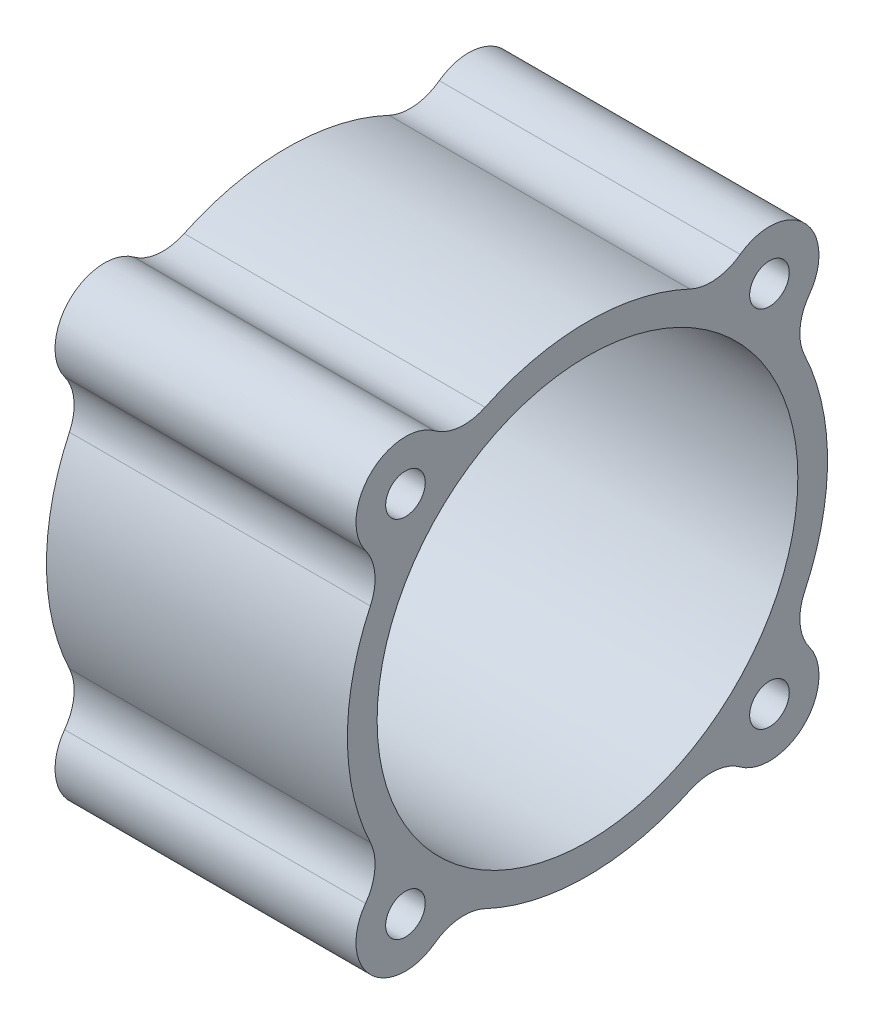
ISO-10303-21;
HEADER;
FILE_DESCRIPTION(('STEP AP214'),'2;1');
FILE_NAME('part.step','',(''),(''),'','','');
FILE_SCHEMA(('AUTOMOTIVE_DESIGN { 1 0 10303 214 1 1 1 1 }'));
ENDSEC;
DATA;
#1=APPLICATION_CONTEXT('core data for automotive mechanical design processes');
#2=APPLICATION_PROTOCOL_DEFINITION('international standard','automotive_design',2000,#1);
#3=PRODUCT_CONTEXT('',#1,'mechanical');
#4=PRODUCT('Part','Part','',(#3));
#5=PRODUCT_RELATED_PRODUCT_CATEGORY('part','',(#4));
#6=PRODUCT_DEFINITION_FORMATION('','',#4);
#7=PRODUCT_DEFINITION_CONTEXT('part definition',#1,'design');
#8=PRODUCT_DEFINITION('design','',#6,#7);
#9=PRODUCT_DEFINITION_SHAPE('','',#8);
#10=(LENGTH_UNIT() NAMED_UNIT(*) SI_UNIT(.MILLI.,.METRE.));
#11=(NAMED_UNIT(*) PLANE_ANGLE_UNIT() SI_UNIT($,.RADIAN.));
#12=(NAMED_UNIT(*) SI_UNIT($,.STERADIAN.) SOLID_ANGLE_UNIT());
#13=UNCERTAINTY_MEASURE_WITH_UNIT(LENGTH_MEASURE(1.E-05),#10,'distance_accuracy_value','');
#14=(GEOMETRIC_REPRESENTATION_CONTEXT(3) GLOBAL_UNCERTAINTY_ASSIGNED_CONTEXT((#13)) GLOBAL_UNIT_ASSIGNED_CONTEXT((#10,
#11,#12)) REPRESENTATION_CONTEXT('',''));
#15=CARTESIAN_POINT('',(0.,0.,0.));
#16=DIRECTION('',(0.,0.,1.));
#17=DIRECTION('',(1.,0.,0.));
#18=AXIS2_PLACEMENT_3D('',#15,#16,#17);
#19=CARTESIAN_POINT('',(15.2,13.2272464074001,6.23943727253676));
#20=DIRECTION('',(1.,0.,0.));
#21=DIRECTION('',(0.,0.,-1.));
#22=AXIS2_PLACEMENT_3D('',#19,#20,#21);
#23=PLANE('',#22);
#24=CARTESIAN_POINT('',(15.2,-18.3847763388395,-18.3847763388395));
#25=DIRECTION('',(1.,0.,0.));
#26=DIRECTION('',(0.,0.,-1.));
#27=AXIS2_PLACEMENT_3D('',#24,#25,#26);
#28=CIRCLE('',#27,2.);
#29=CARTESIAN_POINT('',(15.2,-18.3847763388395,-20.3847763388395));
#30=VERTEX_POINT('',#29);
#31=EDGE_CURVE('E348',#30,#30,#28,.T.);
#32=ORIENTED_EDGE('',*,*,#31,.F.);
#33=EDGE_LOOP('',(#32));
#34=FACE_BOUND('',#33,.T.);
#35=CARTESIAN_POINT('',(15.2,18.3847763388395,18.3847763388395));
#36=DIRECTION('',(1.,0.,0.));
#37=DIRECTION('',(0.,0.,-1.));
#38=AXIS2_PLACEMENT_3D('',#35,#36,#37);
#39=CIRCLE('',#38,2.);
#40=CARTESIAN_POINT('',(15.2,18.3847763388395,16.3847763388395));
#41=VERTEX_POINT('',#40);
#42=EDGE_CURVE('E360',#41,#41,#39,.T.);
#43=ORIENTED_EDGE('',*,*,#42,.F.);
#44=EDGE_LOOP('',(#43));
#45=FACE_BOUND('',#44,.T.);
#46=CARTESIAN_POINT('',(15.2,26.4544928148002,12.4788745450735));
#47=DIRECTION('',(-1.,0.,0.));
#48=DIRECTION('',(0.,0.,-1.));
#49=AXIS2_PLACEMENT_3D('',#46,#47,#48);
#50=CIRCLE('',#49,4.99999999999999);
#51=CARTESIAN_POINT('',(15.2,21.9323572909028,10.3457335971977));
#52=VERTEX_POINT('',#51);
#53=CARTESIAN_POINT('',(15.2,22.4196345768199,15.4318254419565));
#54=VERTEX_POINT('',#53);
#55=EDGE_CURVE('E210',#52,#54,#50,.T.);
#56=ORIENTED_EDGE('',*,*,#55,.T.);
#57=CARTESIAN_POINT('',(15.2,18.3847763388395,18.3847763388395));
#58=DIRECTION('',(1.,0.,0.));
#59=DIRECTION('',(0.,0.,-1.));
#60=AXIS2_PLACEMENT_3D('',#57,#58,#59);
#61=CIRCLE('',#60,5.);
#62=CARTESIAN_POINT('',(15.2,15.4318254419565,22.4196345768199));
#63=VERTEX_POINT('',#62);
#64=EDGE_CURVE('E118',#54,#63,#61,.T.);
#65=ORIENTED_EDGE('',*,*,#64,.T.);
#66=CARTESIAN_POINT('',(15.2,12.4788745450735,26.4544928148002));
#67=DIRECTION('',(-1.,0.,0.));
#68=DIRECTION('',(0.,0.,1.));
#69=AXIS2_PLACEMENT_3D('',#66,#67,#68);
#70=CIRCLE('',#69,5.);
#71=CARTESIAN_POINT('',(15.2,10.3457335971977,21.9323572909027));
#72=VERTEX_POINT('',#71);
#73=EDGE_CURVE('E249',#63,#72,#70,.T.);
#74=ORIENTED_EDGE('',*,*,#73,.T.);
#75=CARTESIAN_POINT('',(15.2,0.,0.));
#76=DIRECTION('',(1.,0.,0.));
#77=DIRECTION('',(0.,0.,-1.));
#78=AXIS2_PLACEMENT_3D('',#75,#76,#77);
#79=CIRCLE('',#78,24.25);
#80=CARTESIAN_POINT('',(15.2,-10.3457335971977,21.9323572909028));
#81=VERTEX_POINT('',#80);
#82=EDGE_CURVE('E268',#72,#81,#79,.T.);
#83=ORIENTED_EDGE('',*,*,#82,.T.);
#84=CARTESIAN_POINT('',(15.2,-12.4788745450735,26.4544928148002));
#85=DIRECTION('',(-1.,0.,0.));
#86=DIRECTION('',(0.,0.,-1.));
#87=AXIS2_PLACEMENT_3D('',#84,#85,#86);
#88=CIRCLE('',#87,5.);
#89=CARTESIAN_POINT('',(15.2,-15.4318254419565,22.4196345768199));
#90=VERTEX_POINT('',#89);
#91=EDGE_CURVE('E265',#81,#90,#88,.T.);
#92=ORIENTED_EDGE('',*,*,#91,.T.);
#93=CARTESIAN_POINT('',(15.2,-18.3847763388395,18.3847763388395));
#94=DIRECTION('',(1.,0.,0.));
#95=DIRECTION('',(0.,0.,-1.));
#96=AXIS2_PLACEMENT_3D('',#93,#94,#95);
#97=CIRCLE('',#96,5.);
#98=CARTESIAN_POINT('',(15.2,-22.4196345768199,15.4318254419565));
#99=VERTEX_POINT('',#98);
#100=EDGE_CURVE('E267',#90,#99,#97,.T.);
#101=ORIENTED_EDGE('',*,*,#100,.T.);
#102=CARTESIAN_POINT('',(15.2,-26.4544928148002,12.4788745450735));
#103=DIRECTION('',(-1.,0.,0.));
#104=DIRECTION('',(0.,0.,1.));
#105=AXIS2_PLACEMENT_3D('',#102,#103,#104);
#106=CIRCLE('',#105,5.);
#107=CARTESIAN_POINT('',(15.2,-21.9323572909028,10.3457335971977));
#108=VERTEX_POINT('',#107);
#109=EDGE_CURVE('E270',#99,#108,#106,.T.);
#110=ORIENTED_EDGE('',*,*,#109,.T.);
#111=CARTESIAN_POINT('',(15.2,0.,0.));
#112=DIRECTION('',(1.,0.,0.));
#113=DIRECTION('',(0.,0.,-1.));
#114=AXIS2_PLACEMENT_3D('',#111,#112,#113);
#115=CIRCLE('',#114,24.25);
#116=CARTESIAN_POINT('',(15.2,-21.9323572909028,-10.3457335971977));
#117=VERTEX_POINT('',#116);
#118=EDGE_CURVE('E276',#108,#117,#115,.T.);
#119=ORIENTED_EDGE('',*,*,#118,.T.);
#120=CARTESIAN_POINT('',(15.2,-26.4544928148002,-12.4788745450735));
#121=DIRECTION('',(-1.,0.,0.));
#122=DIRECTION('',(0.,0.,-1.));
#123=AXIS2_PLACEMENT_3D('',#120,#121,#122);
#124=CIRCLE('',#123,5.);
#125=CARTESIAN_POINT('',(15.2,-22.4196345768199,-15.4318254419565));
#126=VERTEX_POINT('',#125);
#127=EDGE_CURVE('E278',#117,#126,#124,.T.);
#128=ORIENTED_EDGE('',*,*,#127,.T.);
#129=CARTESIAN_POINT('',(15.2,-18.3847763388395,-18.3847763388395));
#130=DIRECTION('',(1.,0.,0.));
#131=DIRECTION('',(0.,0.,-1.));
#132=AXIS2_PLACEMENT_3D('',#129,#130,#131);
#133=CIRCLE('',#132,5.);
#134=CARTESIAN_POINT('',(15.2,-15.4318254419565,-22.4196345768199));
#135=VERTEX_POINT('',#134);
#136=EDGE_CURVE('E280',#126,#135,#133,.T.);
#137=ORIENTED_EDGE('',*,*,#136,.T.);
#138=CARTESIAN_POINT('',(15.2,-12.4788745450735,-26.4544928148002));
#139=DIRECTION('',(-1.,0.,0.));
#140=DIRECTION('',(0.,0.,1.));
#141=AXIS2_PLACEMENT_3D('',#138,#139,#140);
#142=CIRCLE('',#141,5.);
#143=CARTESIAN_POINT('',(15.2,-10.3457335971977,-21.9323572909028));
#144=VERTEX_POINT('',#143);
#145=EDGE_CURVE('E282',#135,#144,#142,.T.);
#146=ORIENTED_EDGE('',*,*,#145,.T.);
#147=CARTESIAN_POINT('',(15.2,0.,0.));
#148=DIRECTION('',(1.,0.,0.));
#149=DIRECTION('',(0.,0.,-1.));
#150=AXIS2_PLACEMENT_3D('',#147,#148,#149);
#151=CIRCLE('',#150,24.25);
#152=CARTESIAN_POINT('',(15.2,10.3457335971977,-21.9323572909028));
#153=VERTEX_POINT('',#152);
#154=EDGE_CURVE('E284',#144,#153,#151,.T.);
#155=ORIENTED_EDGE('',*,*,#154,.T.);
#156=CARTESIAN_POINT('',(15.2,12.4788745450735,-26.4544928148002));
#157=DIRECTION('',(-1.,0.,0.));
#158=DIRECTION('',(0.,0.,-1.));
#159=AXIS2_PLACEMENT_3D('',#156,#157,#158);
#160=CIRCLE('',#159,5.);
#161=CARTESIAN_POINT('',(15.2,15.4318254419565,-22.4196345768199));
#162=VERTEX_POINT('',#161);
#163=EDGE_CURVE('E161',#153,#162,#160,.T.);
#164=ORIENTED_EDGE('',*,*,#163,.T.);
#165=CARTESIAN_POINT('',(15.2,18.3847763388395,-18.3847763388395));
#166=DIRECTION('',(1.,0.,0.));
#167=DIRECTION('',(0.,0.,-1.));
#168=AXIS2_PLACEMENT_3D('',#165,#166,#167);
#169=CIRCLE('',#168,5.);
#170=CARTESIAN_POINT('',(15.2,22.4196345768199,-15.4318254419565));
#171=VERTEX_POINT('',#170);
#172=EDGE_CURVE('E155',#162,#171,#169,.T.);
#173=ORIENTED_EDGE('',*,*,#172,.T.);
#174=CARTESIAN_POINT('',(15.2,26.4544928148002,-12.4788745450735));
#175=DIRECTION('',(-1.,0.,0.));
#176=DIRECTION('',(0.,0.,1.));
#177=AXIS2_PLACEMENT_3D('',#174,#175,#176);
#178=CIRCLE('',#177,5.);
#179=CARTESIAN_POINT('',(15.2,21.9323572909027,-10.3457335971977));
#180=VERTEX_POINT('',#179);
#181=EDGE_CURVE('E159',#171,#180,#178,.T.);
#182=ORIENTED_EDGE('',*,*,#181,.T.);
#183=CARTESIAN_POINT('',(15.2,0.,0.));
#184=DIRECTION('',(1.,0.,0.));
#185=DIRECTION('',(0.,0.,-1.));
#186=AXIS2_PLACEMENT_3D('',#183,#184,#185);
#187=CIRCLE('',#186,24.25);
#188=EDGE_CURVE('E51',#180,#52,#187,.T.);
#189=ORIENTED_EDGE('',*,*,#188,.T.);
#190=EDGE_LOOP('',(#56,#65,#74,#83,#92,#101,#110,#119,#128,#137,#146,#155,#164,#173,#182,#189));
#191=FACE_BOUND('',#190,.T.);
#192=CARTESIAN_POINT('',(15.2,0.,0.));
#193=DIRECTION('',(1.,0.,0.));
#194=DIRECTION('',(0.,0.,-1.));
#195=AXIS2_PLACEMENT_3D('',#192,#193,#194);
#196=CIRCLE('',#195,21.25);
#197=CARTESIAN_POINT('',(15.2,0.,-21.25));
#198=VERTEX_POINT('',#197);
#199=EDGE_CURVE('E183',#198,#198,#196,.T.);
#200=ORIENTED_EDGE('',*,*,#199,.F.);
#201=EDGE_LOOP('',(#200));
#202=FACE_BOUND('',#201,.T.);
#203=CARTESIAN_POINT('',(15.2,18.3847763388395,-18.3847763388395));
#204=DIRECTION('',(1.,0.,0.));
#205=DIRECTION('',(0.,0.,-1.));
#206=AXIS2_PLACEMENT_3D('',#203,#204,#205);
#207=CIRCLE('',#206,2.00000000000001);
#208=CARTESIAN_POINT('',(15.2,18.3847763388395,-20.3847763388395));
#209=VERTEX_POINT('',#208);
#210=EDGE_CURVE('E354',#209,#209,#207,.T.);
#211=ORIENTED_EDGE('',*,*,#210,.F.);
#212=EDGE_LOOP('',(#211));
#213=FACE_BOUND('',#212,.T.);
#214=CARTESIAN_POINT('',(15.2,-18.3847763388395,18.3847763388395));
#215=DIRECTION('',(1.,0.,0.));
#216=DIRECTION('',(0.,0.,-1.));
#217=AXIS2_PLACEMENT_3D('',#214,#215,#216);
#218=CIRCLE('',#217,2.00000000000001);
#219=CARTESIAN_POINT('',(15.2,-18.3847763388395,16.3847763388395));
#220=VERTEX_POINT('',#219);
#221=EDGE_CURVE('E339',#220,#220,#218,.T.);
#222=ORIENTED_EDGE('',*,*,#221,.F.);
#223=EDGE_LOOP('',(#222));
#224=FACE_BOUND('',#223,.T.);
#225=ADVANCED_FACE('F34',(#34,#45,#191,#202,#213,#224),#23,.T.);
#226=CARTESIAN_POINT('',(-15.2,13.2272464074001,6.23943727253676));
#227=DIRECTION('',(1.,0.,0.));
#228=DIRECTION('',(0.,0.,-1.));
#229=AXIS2_PLACEMENT_3D('',#226,#227,#228);
#230=PLANE('',#229);
#231=CARTESIAN_POINT('',(-15.2,26.4544928148002,12.4788745450735));
#232=DIRECTION('',(-1.,0.,0.));
#233=DIRECTION('',(0.,0.,-1.));
#234=AXIS2_PLACEMENT_3D('',#231,#232,#233);
#235=CIRCLE('',#234,4.99999999999999);
#236=CARTESIAN_POINT('',(-15.2,21.9323572909028,10.3457335971977));
#237=VERTEX_POINT('',#236);
#238=CARTESIAN_POINT('',(-15.2,22.4196345768199,15.4318254419565));
#239=VERTEX_POINT('',#238);
#240=EDGE_CURVE('E179',#237,#239,#235,.T.);
#241=ORIENTED_EDGE('',*,*,#240,.F.);
#242=CARTESIAN_POINT('',(-15.2,0.,0.));
#243=DIRECTION('',(1.,0.,0.));
#244=DIRECTION('',(0.,0.,-1.));
#245=AXIS2_PLACEMENT_3D('',#242,#243,#244);
#246=CIRCLE('',#245,24.25);
#247=CARTESIAN_POINT('',(-15.2,21.9323572909027,-10.3457335971977));
#248=VERTEX_POINT('',#247);
#249=EDGE_CURVE('E110',#248,#237,#246,.T.);
#250=ORIENTED_EDGE('',*,*,#249,.F.);
#251=CARTESIAN_POINT('',(-15.2,26.4544928148002,-12.4788745450735));
#252=DIRECTION('',(-1.,0.,0.));
#253=DIRECTION('',(0.,0.,1.));
#254=AXIS2_PLACEMENT_3D('',#251,#252,#253);
#255=CIRCLE('',#254,5.);
#256=CARTESIAN_POINT('',(-15.2,22.4196345768199,-15.4318254419565));
#257=VERTEX_POINT('',#256);
#258=EDGE_CURVE('E104',#257,#248,#255,.T.);
#259=ORIENTED_EDGE('',*,*,#258,.F.);
#260=CARTESIAN_POINT('',(-15.2,18.3847763388395,-18.3847763388395));
#261=DIRECTION('',(1.,0.,0.));
#262=DIRECTION('',(0.,0.,-1.));
#263=AXIS2_PLACEMENT_3D('',#260,#261,#262);
#264=CIRCLE('',#263,5.);
#265=CARTESIAN_POINT('',(-15.2,15.4318254419565,-22.4196345768199));
#266=VERTEX_POINT('',#265);
#267=EDGE_CURVE('E169',#266,#257,#264,.T.);
#268=ORIENTED_EDGE('',*,*,#267,.F.);
#269=CARTESIAN_POINT('',(-15.2,12.4788745450735,-26.4544928148002));
#270=DIRECTION('',(-1.,0.,0.));
#271=DIRECTION('',(0.,0.,-1.));
#272=AXIS2_PLACEMENT_3D('',#269,#270,#271);
#273=CIRCLE('',#272,5.);
#274=CARTESIAN_POINT('',(-15.2,10.3457335971977,-21.9323572909028));
#275=VERTEX_POINT('',#274);
#276=EDGE_CURVE('E205',#275,#266,#273,.T.);
#277=ORIENTED_EDGE('',*,*,#276,.F.);
#278=CARTESIAN_POINT('',(-15.2,0.,0.));
#279=DIRECTION('',(1.,0.,0.));
#280=DIRECTION('',(0.,0.,-1.));
#281=AXIS2_PLACEMENT_3D('',#278,#279,#280);
#282=CIRCLE('',#281,24.25);
#283=CARTESIAN_POINT('',(-15.2,-10.3457335971977,-21.9323572909028));
#284=VERTEX_POINT('',#283);
#285=EDGE_CURVE('E203',#284,#275,#282,.T.);
#286=ORIENTED_EDGE('',*,*,#285,.F.);
#287=CARTESIAN_POINT('',(-15.2,-12.4788745450735,-26.4544928148002));
#288=DIRECTION('',(-1.,0.,0.));
#289=DIRECTION('',(0.,0.,1.));
#290=AXIS2_PLACEMENT_3D('',#287,#288,#289);
#291=CIRCLE('',#290,5.);
#292=CARTESIAN_POINT('',(-15.2,-15.4318254419565,-22.4196345768199));
#293=VERTEX_POINT('',#292);
#294=EDGE_CURVE('E201',#293,#284,#291,.T.);
#295=ORIENTED_EDGE('',*,*,#294,.F.);
#296=CARTESIAN_POINT('',(-15.2,-18.3847763388395,-18.3847763388395));
#297=DIRECTION('',(1.,0.,0.));
#298=DIRECTION('',(0.,0.,-1.));
#299=AXIS2_PLACEMENT_3D('',#296,#297,#298);
#300=CIRCLE('',#299,5.);
#301=CARTESIAN_POINT('',(-15.2,-22.4196345768199,-15.4318254419565));
#302=VERTEX_POINT('',#301);
#303=EDGE_CURVE('E199',#302,#293,#300,.T.);
#304=ORIENTED_EDGE('',*,*,#303,.F.);
#305=CARTESIAN_POINT('',(-15.2,-26.4544928148002,-12.4788745450735));
#306=DIRECTION('',(-1.,0.,0.));
#307=DIRECTION('',(0.,0.,-1.));
#308=AXIS2_PLACEMENT_3D('',#305,#306,#307);
#309=CIRCLE('',#308,5.);
#310=CARTESIAN_POINT('',(-15.2,-21.9323572909028,-10.3457335971977));
#311=VERTEX_POINT('',#310);
#312=EDGE_CURVE('E197',#311,#302,#309,.T.);
#313=ORIENTED_EDGE('',*,*,#312,.F.);
#314=CARTESIAN_POINT('',(-15.2,0.,0.));
#315=DIRECTION('',(1.,0.,0.));
#316=DIRECTION('',(0.,0.,-1.));
#317=AXIS2_PLACEMENT_3D('',#314,#315,#316);
#318=CIRCLE('',#317,24.25);
#319=CARTESIAN_POINT('',(-15.2,-21.9323572909028,10.3457335971977));
#320=VERTEX_POINT('',#319);
#321=EDGE_CURVE('E195',#320,#311,#318,.T.);
#322=ORIENTED_EDGE('',*,*,#321,.F.);
#323=CARTESIAN_POINT('',(-15.2,-26.4544928148002,12.4788745450735));
#324=DIRECTION('',(-1.,0.,0.));
#325=DIRECTION('',(0.,0.,1.));
#326=AXIS2_PLACEMENT_3D('',#323,#324,#325);
#327=CIRCLE('',#326,5.);
#328=CARTESIAN_POINT('',(-15.2,-22.4196345768199,15.4318254419565));
#329=VERTEX_POINT('',#328);
#330=EDGE_CURVE('E193',#329,#320,#327,.T.);
#331=ORIENTED_EDGE('',*,*,#330,.F.);
#332=CARTESIAN_POINT('',(-15.2,-18.3847763388395,18.3847763388395));
#333=DIRECTION('',(1.,0.,0.));
#334=DIRECTION('',(0.,0.,-1.));
#335=AXIS2_PLACEMENT_3D('',#332,#333,#334);
#336=CIRCLE('',#335,5.);
#337=CARTESIAN_POINT('',(-15.2,-15.4318254419565,22.4196345768199));
#338=VERTEX_POINT('',#337);
#339=EDGE_CURVE('E191',#338,#329,#336,.T.);
#340=ORIENTED_EDGE('',*,*,#339,.F.);
#341=CARTESIAN_POINT('',(-15.2,-12.4788745450735,26.4544928148002));
#342=DIRECTION('',(-1.,0.,0.));
#343=DIRECTION('',(0.,0.,-1.));
#344=AXIS2_PLACEMENT_3D('',#341,#342,#343);
#345=CIRCLE('',#344,5.);
#346=CARTESIAN_POINT('',(-15.2,-10.3457335971977,21.9323572909028));
#347=VERTEX_POINT('',#346);
#348=EDGE_CURVE('E189',#347,#338,#345,.T.);
#349=ORIENTED_EDGE('',*,*,#348,.F.);
#350=CARTESIAN_POINT('',(-15.2,0.,0.));
#351=DIRECTION('',(1.,0.,0.));
#352=DIRECTION('',(0.,0.,-1.));
#353=AXIS2_PLACEMENT_3D('',#350,#351,#352);
#354=CIRCLE('',#353,24.25);
#355=CARTESIAN_POINT('',(-15.2,10.3457335971977,21.9323572909027));
#356=VERTEX_POINT('',#355);
#357=EDGE_CURVE('E187',#356,#347,#354,.T.);
#358=ORIENTED_EDGE('',*,*,#357,.F.);
#359=CARTESIAN_POINT('',(-15.2,12.4788745450735,26.4544928148002));
#360=DIRECTION('',(-1.,0.,0.));
#361=DIRECTION('',(0.,0.,1.));
#362=AXIS2_PLACEMENT_3D('',#359,#360,#361);
#363=CIRCLE('',#362,5.);
#364=CARTESIAN_POINT('',(-15.2,15.4318254419565,22.4196345768199));
#365=VERTEX_POINT('',#364);
#366=EDGE_CURVE('E185',#365,#356,#363,.T.);
#367=ORIENTED_EDGE('',*,*,#366,.F.);
#368=CARTESIAN_POINT('',(-15.2,18.3847763388395,18.3847763388395));
#369=DIRECTION('',(1.,0.,0.));
#370=DIRECTION('',(0.,0.,-1.));
#371=AXIS2_PLACEMENT_3D('',#368,#369,#370);
#372=CIRCLE('',#371,5.);
#373=EDGE_CURVE('E182',#239,#365,#372,.T.);
#374=ORIENTED_EDGE('',*,*,#373,.F.);
#375=EDGE_LOOP('',(#241,#250,#259,#268,#277,#286,#295,#304,#313,#322,#331,#340,#349,#358,#367,#374));
#376=FACE_BOUND('',#375,.T.);
#377=CARTESIAN_POINT('',(-15.2,0.,0.));
#378=DIRECTION('',(1.,0.,0.));
#379=DIRECTION('',(0.,0.,-1.));
#380=AXIS2_PLACEMENT_3D('',#377,#378,#379);
#381=CIRCLE('',#380,21.25);
#382=CARTESIAN_POINT('',(-15.2,0.,-21.25));
#383=VERTEX_POINT('',#382);
#384=EDGE_CURVE('E363',#383,#383,#381,.T.);
#385=ORIENTED_EDGE('',*,*,#384,.T.);
#386=EDGE_LOOP('',(#385));
#387=FACE_BOUND('',#386,.T.);
#388=CARTESIAN_POINT('',(-15.2,18.3847763388395,18.3847763388395));
#389=DIRECTION('',(1.,0.,0.));
#390=DIRECTION('',(0.,0.,-1.));
#391=AXIS2_PLACEMENT_3D('',#388,#389,#390);
#392=CIRCLE('',#391,2.);
#393=CARTESIAN_POINT('',(-15.2,18.3847763388395,16.3847763388395));
#394=VERTEX_POINT('',#393);
#395=EDGE_CURVE('E357',#394,#394,#392,.T.);
#396=ORIENTED_EDGE('',*,*,#395,.T.);
#397=EDGE_LOOP('',(#396));
#398=FACE_BOUND('',#397,.T.);
#399=CARTESIAN_POINT('',(-15.2,18.3847763388395,-18.3847763388395));
#400=DIRECTION('',(1.,0.,0.));
#401=DIRECTION('',(0.,0.,-1.));
#402=AXIS2_PLACEMENT_3D('',#399,#400,#401);
#403=CIRCLE('',#402,2.00000000000001);
#404=CARTESIAN_POINT('',(-15.2,18.3847763388395,-20.3847763388395));
#405=VERTEX_POINT('',#404);
#406=EDGE_CURVE('E351',#405,#405,#403,.T.);
#407=ORIENTED_EDGE('',*,*,#406,.T.);
#408=EDGE_LOOP('',(#407));
#409=FACE_BOUND('',#408,.T.);
#410=CARTESIAN_POINT('',(-15.2,-18.3847763388395,-18.3847763388395));
#411=DIRECTION('',(1.,0.,0.));
#412=DIRECTION('',(0.,0.,-1.));
#413=AXIS2_PLACEMENT_3D('',#410,#411,#412);
#414=CIRCLE('',#413,2.);
#415=CARTESIAN_POINT('',(-15.2,-18.3847763388395,-20.3847763388395));
#416=VERTEX_POINT('',#415);
#417=EDGE_CURVE('E345',#416,#416,#414,.T.);
#418=ORIENTED_EDGE('',*,*,#417,.T.);
#419=EDGE_LOOP('',(#418));
#420=FACE_BOUND('',#419,.T.);
#421=CARTESIAN_POINT('',(-15.2,-18.3847763388395,18.3847763388395));
#422=DIRECTION('',(1.,0.,0.));
#423=DIRECTION('',(0.,0.,-1.));
#424=AXIS2_PLACEMENT_3D('',#421,#422,#423);
#425=CIRCLE('',#424,2.00000000000001);
#426=CARTESIAN_POINT('',(-15.2,-18.3847763388395,16.3847763388395));
#427=VERTEX_POINT('',#426);
#428=EDGE_CURVE('E342',#427,#427,#425,.T.);
#429=ORIENTED_EDGE('',*,*,#428,.T.);
#430=EDGE_LOOP('',(#429));
#431=FACE_BOUND('',#430,.T.);
#432=ADVANCED_FACE('F253',(#376,#387,#398,#409,#420,#431),#230,.F.);
#433=CARTESIAN_POINT('',(15.2,26.4544928148002,12.4788745450735));
#434=DIRECTION('',(-1.,0.,0.));
#435=DIRECTION('',(0.,0.,1.));
#436=AXIS2_PLACEMENT_3D('',#433,#434,#435);
#437=CYLINDRICAL_SURFACE('',#436,4.99999999999999);
#438=ORIENTED_EDGE('',*,*,#240,.T.);
#439=DIRECTION('',(-1.,0.,0.));
#440=VECTOR('',#439,1.);
#441=CARTESIAN_POINT('',(15.2,22.4196345768199,15.4318254419565));
#442=LINE('',#441,#440);
#443=EDGE_CURVE('E11',#54,#239,#442,.T.);
#444=ORIENTED_EDGE('',*,*,#443,.F.);
#445=ORIENTED_EDGE('',*,*,#55,.F.);
#446=DIRECTION('',(-1.,0.,0.));
#447=VECTOR('',#446,1.);
#448=CARTESIAN_POINT('',(15.2,21.9323572909028,10.3457335971977));
#449=LINE('',#448,#447);
#450=EDGE_CURVE('E175',#52,#237,#449,.T.);
#451=ORIENTED_EDGE('',*,*,#450,.T.);
#452=EDGE_LOOP('',(#438,#444,#445,#451));
#453=FACE_BOUND('',#452,.T.);
#454=ADVANCED_FACE('F36',(#453),#437,.F.);
#455=CARTESIAN_POINT('',(15.2,18.3847763388395,18.3847763388395));
#456=DIRECTION('',(-1.,0.,0.));
#457=DIRECTION('',(0.,0.,1.));
#458=AXIS2_PLACEMENT_3D('',#455,#456,#457);
#459=CYLINDRICAL_SURFACE('',#458,5.);
#460=ORIENTED_EDGE('',*,*,#373,.T.);
#461=DIRECTION('',(-1.,0.,0.));
#462=VECTOR('',#461,1.);
#463=CARTESIAN_POINT('',(15.2,15.4318254419565,22.4196345768199));
#464=LINE('',#463,#462);
#465=EDGE_CURVE('E43',#63,#365,#464,.T.);
#466=ORIENTED_EDGE('',*,*,#465,.F.);
#467=ORIENTED_EDGE('',*,*,#64,.F.);
#468=ORIENTED_EDGE('',*,*,#443,.T.);
#469=EDGE_LOOP('',(#460,#466,#467,#468));
#470=FACE_BOUND('',#469,.T.);
#471=ADVANCED_FACE('F522',(#470),#459,.T.);
#472=CARTESIAN_POINT('',(15.2,12.4788745450735,26.4544928148002));
#473=DIRECTION('',(-1.,0.,0.));
#474=DIRECTION('',(0.,0.,1.));
#475=AXIS2_PLACEMENT_3D('',#472,#473,#474);
#476=CYLINDRICAL_SURFACE('',#475,5.);
#477=ORIENTED_EDGE('',*,*,#366,.T.);
#478=DIRECTION('',(-1.,0.,0.));
#479=VECTOR('',#478,1.);
#480=CARTESIAN_POINT('',(15.2,10.3457335971977,21.9323572909027));
#481=LINE('',#480,#479);
#482=EDGE_CURVE('E241',#72,#356,#481,.T.);
#483=ORIENTED_EDGE('',*,*,#482,.F.);
#484=ORIENTED_EDGE('',*,*,#73,.F.);
#485=ORIENTED_EDGE('',*,*,#465,.T.);
#486=EDGE_LOOP('',(#477,#483,#484,#485));
#487=FACE_BOUND('',#486,.T.);
#488=ADVANCED_FACE('F247',(#487),#476,.F.);
#489=CARTESIAN_POINT('',(15.2,0.,0.));
#490=DIRECTION('',(-1.,0.,0.));
#491=DIRECTION('',(0.,0.,1.));
#492=AXIS2_PLACEMENT_3D('',#489,#490,#491);
#493=CYLINDRICAL_SURFACE('',#492,24.25);
#494=ORIENTED_EDGE('',*,*,#357,.T.);
#495=DIRECTION('',(-1.,0.,0.));
#496=VECTOR('',#495,1.);
#497=CARTESIAN_POINT('',(15.2,-10.3457335971977,21.9323572909028));
#498=LINE('',#497,#496);
#499=EDGE_CURVE('E238',#81,#347,#498,.T.);
#500=ORIENTED_EDGE('',*,*,#499,.F.);
#501=ORIENTED_EDGE('',*,*,#82,.F.);
#502=ORIENTED_EDGE('',*,*,#482,.T.);
#503=EDGE_LOOP('',(#494,#500,#501,#502));
#504=FACE_BOUND('',#503,.T.);
#505=ADVANCED_FACE('F259',(#504),#493,.T.);
#506=CARTESIAN_POINT('',(15.2,-12.4788745450735,26.4544928148002));
#507=DIRECTION('',(-1.,0.,0.));
#508=DIRECTION('',(0.,0.,1.));
#509=AXIS2_PLACEMENT_3D('',#506,#507,#508);
#510=CYLINDRICAL_SURFACE('',#509,5.);
#511=ORIENTED_EDGE('',*,*,#348,.T.);
#512=DIRECTION('',(-1.,0.,0.));
#513=VECTOR('',#512,1.);
#514=CARTESIAN_POINT('',(15.2,-15.4318254419565,22.4196345768199));
#515=LINE('',#514,#513);
#516=EDGE_CURVE('E235',#90,#338,#515,.T.);
#517=ORIENTED_EDGE('',*,*,#516,.F.);
#518=ORIENTED_EDGE('',*,*,#91,.F.);
#519=ORIENTED_EDGE('',*,*,#499,.T.);
#520=EDGE_LOOP('',(#511,#517,#518,#519));
#521=FACE_BOUND('',#520,.T.);
#522=ADVANCED_FACE('F263',(#521),#510,.F.);
#523=CARTESIAN_POINT('',(15.2,-18.3847763388395,18.3847763388395));
#524=DIRECTION('',(-1.,0.,0.));
#525=DIRECTION('',(0.,0.,1.));
#526=AXIS2_PLACEMENT_3D('',#523,#524,#525);
#527=CYLINDRICAL_SURFACE('',#526,5.);
#528=ORIENTED_EDGE('',*,*,#339,.T.);
#529=DIRECTION('',(-1.,0.,0.));
#530=VECTOR('',#529,1.);
#531=CARTESIAN_POINT('',(15.2,-22.4196345768199,15.4318254419565));
#532=LINE('',#531,#530);
#533=EDGE_CURVE('E232',#99,#329,#532,.T.);
#534=ORIENTED_EDGE('',*,*,#533,.F.);
#535=ORIENTED_EDGE('',*,*,#100,.F.);
#536=ORIENTED_EDGE('',*,*,#516,.T.);
#537=EDGE_LOOP('',(#528,#534,#535,#536));
#538=FACE_BOUND('',#537,.T.);
#539=ADVANCED_FACE('F487',(#538),#527,.T.);
#540=CARTESIAN_POINT('',(15.2,-26.4544928148002,12.4788745450735));
#541=DIRECTION('',(-1.,0.,0.));
#542=DIRECTION('',(0.,0.,1.));
#543=AXIS2_PLACEMENT_3D('',#540,#541,#542);
#544=CYLINDRICAL_SURFACE('',#543,5.);
#545=ORIENTED_EDGE('',*,*,#330,.T.);
#546=DIRECTION('',(-1.,0.,0.));
#547=VECTOR('',#546,1.);
#548=CARTESIAN_POINT('',(15.2,-21.9323572909028,10.3457335971977));
#549=LINE('',#548,#547);
#550=EDGE_CURVE('E229',#108,#320,#549,.T.);
#551=ORIENTED_EDGE('',*,*,#550,.F.);
#552=ORIENTED_EDGE('',*,*,#109,.F.);
#553=ORIENTED_EDGE('',*,*,#533,.T.);
#554=EDGE_LOOP('',(#545,#551,#552,#553));
#555=FACE_BOUND('',#554,.T.);
#556=ADVANCED_FACE('F477',(#555),#544,.F.);
#557=CARTESIAN_POINT('',(15.2,0.,0.));
#558=DIRECTION('',(-1.,0.,0.));
#559=DIRECTION('',(0.,0.,1.));
#560=AXIS2_PLACEMENT_3D('',#557,#558,#559);
#561=CYLINDRICAL_SURFACE('',#560,24.25);
#562=ORIENTED_EDGE('',*,*,#321,.T.);
#563=DIRECTION('',(-1.,0.,0.));
#564=VECTOR('',#563,1.);
#565=CARTESIAN_POINT('',(15.2,-21.9323572909028,-10.3457335971977));
#566=LINE('',#565,#564);
#567=EDGE_CURVE('E226',#117,#311,#566,.T.);
#568=ORIENTED_EDGE('',*,*,#567,.F.);
#569=ORIENTED_EDGE('',*,*,#118,.F.);
#570=ORIENTED_EDGE('',*,*,#550,.T.);
#571=EDGE_LOOP('',(#562,#568,#569,#570));
#572=FACE_BOUND('',#571,.T.);
#573=ADVANCED_FACE('F467',(#572),#561,.T.);
#574=CARTESIAN_POINT('',(15.2,-26.4544928148002,-12.4788745450735));
#575=DIRECTION('',(-1.,0.,0.));
#576=DIRECTION('',(0.,0.,1.));
#577=AXIS2_PLACEMENT_3D('',#574,#575,#576);
#578=CYLINDRICAL_SURFACE('',#577,5.);
#579=ORIENTED_EDGE('',*,*,#312,.T.);
#580=DIRECTION('',(-1.,0.,0.));
#581=VECTOR('',#580,1.);
#582=CARTESIAN_POINT('',(15.2,-22.4196345768199,-15.4318254419565));
#583=LINE('',#582,#581);
#584=EDGE_CURVE('E223',#126,#302,#583,.T.);
#585=ORIENTED_EDGE('',*,*,#584,.F.);
#586=ORIENTED_EDGE('',*,*,#127,.F.);
#587=ORIENTED_EDGE('',*,*,#567,.T.);
#588=EDGE_LOOP('',(#579,#585,#586,#587));
#589=FACE_BOUND('',#588,.T.);
#590=ADVANCED_FACE('F457',(#589),#578,.F.);
#591=CARTESIAN_POINT('',(15.2,-18.3847763388395,-18.3847763388395));
#592=DIRECTION('',(-1.,0.,0.));
#593=DIRECTION('',(0.,0.,1.));
#594=AXIS2_PLACEMENT_3D('',#591,#592,#593);
#595=CYLINDRICAL_SURFACE('',#594,5.);
#596=ORIENTED_EDGE('',*,*,#303,.T.);
#597=DIRECTION('',(-1.,0.,0.));
#598=VECTOR('',#597,1.);
#599=CARTESIAN_POINT('',(15.2,-15.4318254419565,-22.4196345768199));
#600=LINE('',#599,#598);
#601=EDGE_CURVE('E220',#135,#293,#600,.T.);
#602=ORIENTED_EDGE('',*,*,#601,.F.);
#603=ORIENTED_EDGE('',*,*,#136,.F.);
#604=ORIENTED_EDGE('',*,*,#584,.T.);
#605=EDGE_LOOP('',(#596,#602,#603,#604));
#606=FACE_BOUND('',#605,.T.);
#607=ADVANCED_FACE('F447',(#606),#595,.T.);
#608=CARTESIAN_POINT('',(15.2,-12.4788745450735,-26.4544928148002));
#609=DIRECTION('',(-1.,0.,0.));
#610=DIRECTION('',(0.,0.,1.));
#611=AXIS2_PLACEMENT_3D('',#608,#609,#610);
#612=CYLINDRICAL_SURFACE('',#611,5.);
#613=ORIENTED_EDGE('',*,*,#294,.T.);
#614=DIRECTION('',(-1.,0.,0.));
#615=VECTOR('',#614,1.);
#616=CARTESIAN_POINT('',(15.2,-10.3457335971977,-21.9323572909028));
#617=LINE('',#616,#615);
#618=EDGE_CURVE('E217',#144,#284,#617,.T.);
#619=ORIENTED_EDGE('',*,*,#618,.F.);
#620=ORIENTED_EDGE('',*,*,#145,.F.);
#621=ORIENTED_EDGE('',*,*,#601,.T.);
#622=EDGE_LOOP('',(#613,#619,#620,#621));
#623=FACE_BOUND('',#622,.T.);
#624=ADVANCED_FACE('F438',(#623),#612,.F.);
#625=CARTESIAN_POINT('',(15.2,0.,0.));
#626=DIRECTION('',(-1.,0.,0.));
#627=DIRECTION('',(0.,0.,1.));
#628=AXIS2_PLACEMENT_3D('',#625,#626,#627);
#629=CYLINDRICAL_SURFACE('',#628,24.25);
#630=ORIENTED_EDGE('',*,*,#285,.T.);
#631=DIRECTION('',(-1.,0.,0.));
#632=VECTOR('',#631,1.);
#633=CARTESIAN_POINT('',(15.2,10.3457335971977,-21.9323572909028));
#634=LINE('',#633,#632);
#635=EDGE_CURVE('E214',#153,#275,#634,.T.);
#636=ORIENTED_EDGE('',*,*,#635,.F.);
#637=ORIENTED_EDGE('',*,*,#154,.F.);
#638=ORIENTED_EDGE('',*,*,#618,.T.);
#639=EDGE_LOOP('',(#630,#636,#637,#638));
#640=FACE_BOUND('',#639,.T.);
#641=ADVANCED_FACE('F290',(#640),#629,.T.);
#642=CARTESIAN_POINT('',(15.2,12.4788745450735,-26.4544928148002));
#643=DIRECTION('',(-1.,0.,0.));
#644=DIRECTION('',(0.,0.,1.));
#645=AXIS2_PLACEMENT_3D('',#642,#643,#644);
#646=CYLINDRICAL_SURFACE('',#645,5.);
#647=ORIENTED_EDGE('',*,*,#276,.T.);
#648=DIRECTION('',(-1.,0.,0.));
#649=VECTOR('',#648,1.);
#650=CARTESIAN_POINT('',(15.2,15.4318254419565,-22.4196345768199));
#651=LINE('',#650,#649);
#652=EDGE_CURVE('E170',#162,#266,#651,.T.);
#653=ORIENTED_EDGE('',*,*,#652,.F.);
#654=ORIENTED_EDGE('',*,*,#163,.F.);
#655=ORIENTED_EDGE('',*,*,#635,.T.);
#656=EDGE_LOOP('',(#647,#653,#654,#655));
#657=FACE_BOUND('',#656,.T.);
#658=ADVANCED_FACE('F294',(#657),#646,.F.);
#659=CARTESIAN_POINT('',(15.2,18.3847763388395,-18.3847763388395));
#660=DIRECTION('',(-1.,0.,0.));
#661=DIRECTION('',(0.,0.,1.));
#662=AXIS2_PLACEMENT_3D('',#659,#660,#661);
#663=CYLINDRICAL_SURFACE('',#662,5.);
#664=ORIENTED_EDGE('',*,*,#267,.T.);
#665=DIRECTION('',(-1.,0.,0.));
#666=VECTOR('',#665,1.);
#667=CARTESIAN_POINT('',(15.2,22.4196345768199,-15.4318254419565));
#668=LINE('',#667,#666);
#669=EDGE_CURVE('E166',#171,#257,#668,.T.);
#670=ORIENTED_EDGE('',*,*,#669,.F.);
#671=ORIENTED_EDGE('',*,*,#172,.F.);
#672=ORIENTED_EDGE('',*,*,#652,.T.);
#673=EDGE_LOOP('',(#664,#670,#671,#672));
#674=FACE_BOUND('',#673,.T.);
#675=ADVANCED_FACE('F167',(#674),#663,.T.);
#676=CARTESIAN_POINT('',(15.2,26.4544928148002,-12.4788745450735));
#677=DIRECTION('',(-1.,0.,0.));
#678=DIRECTION('',(0.,0.,1.));
#679=AXIS2_PLACEMENT_3D('',#676,#677,#678);
#680=CYLINDRICAL_SURFACE('',#679,5.);
#681=ORIENTED_EDGE('',*,*,#258,.T.);
#682=DIRECTION('',(-1.,0.,0.));
#683=VECTOR('',#682,1.);
#684=CARTESIAN_POINT('',(15.2,21.9323572909027,-10.3457335971977));
#685=LINE('',#684,#683);
#686=EDGE_CURVE('E171',#180,#248,#685,.T.);
#687=ORIENTED_EDGE('',*,*,#686,.F.);
#688=ORIENTED_EDGE('',*,*,#181,.F.);
#689=ORIENTED_EDGE('',*,*,#669,.T.);
#690=EDGE_LOOP('',(#681,#687,#688,#689));
#691=FACE_BOUND('',#690,.T.);
#692=ADVANCED_FACE('F173',(#691),#680,.F.);
#693=CARTESIAN_POINT('',(15.2,0.,0.));
#694=DIRECTION('',(-1.,0.,0.));
#695=DIRECTION('',(0.,0.,1.));
#696=AXIS2_PLACEMENT_3D('',#693,#694,#695);
#697=CYLINDRICAL_SURFACE('',#696,24.25);
#698=ORIENTED_EDGE('',*,*,#249,.T.);
#699=ORIENTED_EDGE('',*,*,#450,.F.);
#700=ORIENTED_EDGE('',*,*,#188,.F.);
#701=ORIENTED_EDGE('',*,*,#686,.T.);
#702=EDGE_LOOP('',(#698,#699,#700,#701));
#703=FACE_BOUND('',#702,.T.);
#704=ADVANCED_FACE('F298',(#703),#697,.T.);
#705=CARTESIAN_POINT('',(15.2,0.,0.));
#706=DIRECTION('',(-1.,0.,0.));
#707=DIRECTION('',(0.,0.,1.));
#708=AXIS2_PLACEMENT_3D('',#705,#706,#707);
#709=CYLINDRICAL_SURFACE('',#708,21.25);
#710=ORIENTED_EDGE('',*,*,#199,.T.);
#711=EDGE_LOOP('',(#710));
#712=FACE_BOUND('',#711,.T.);
#713=ORIENTED_EDGE('',*,*,#384,.F.);
#714=EDGE_LOOP('',(#713));
#715=FACE_BOUND('',#714,.T.);
#716=ADVANCED_FACE('F300',(#712,#715),#709,.F.);
#717=CARTESIAN_POINT('',(15.2,18.3847763388395,18.3847763388395));
#718=DIRECTION('',(-1.,0.,0.));
#719=DIRECTION('',(0.,0.,1.));
#720=AXIS2_PLACEMENT_3D('',#717,#718,#719);
#721=CYLINDRICAL_SURFACE('',#720,2.);
#722=ORIENTED_EDGE('',*,*,#42,.T.);
#723=EDGE_LOOP('',(#722));
#724=FACE_BOUND('',#723,.T.);
#725=ORIENTED_EDGE('',*,*,#395,.F.);
#726=EDGE_LOOP('',(#725));
#727=FACE_BOUND('',#726,.T.);
#728=ADVANCED_FACE('F306',(#724,#727),#721,.F.);
#729=CARTESIAN_POINT('',(15.2,18.3847763388395,-18.3847763388395));
#730=DIRECTION('',(-1.,0.,0.));
#731=DIRECTION('',(0.,0.,1.));
#732=AXIS2_PLACEMENT_3D('',#729,#730,#731);
#733=CYLINDRICAL_SURFACE('',#732,2.00000000000001);
#734=ORIENTED_EDGE('',*,*,#210,.T.);
#735=EDGE_LOOP('',(#734));
#736=FACE_BOUND('',#735,.T.);
#737=ORIENTED_EDGE('',*,*,#406,.F.);
#738=EDGE_LOOP('',(#737));
#739=FACE_BOUND('',#738,.T.);
#740=ADVANCED_FACE('F322',(#736,#739),#733,.F.);
#741=CARTESIAN_POINT('',(15.2,-18.3847763388395,-18.3847763388395));
#742=DIRECTION('',(-1.,0.,0.));
#743=DIRECTION('',(0.,0.,1.));
#744=AXIS2_PLACEMENT_3D('',#741,#742,#743);
#745=CYLINDRICAL_SURFACE('',#744,2.);
#746=ORIENTED_EDGE('',*,*,#31,.T.);
#747=EDGE_LOOP('',(#746));
#748=FACE_BOUND('',#747,.T.);
#749=ORIENTED_EDGE('',*,*,#417,.F.);
#750=EDGE_LOOP('',(#749));
#751=FACE_BOUND('',#750,.T.);
#752=ADVANCED_FACE('F326',(#748,#751),#745,.F.);
#753=CARTESIAN_POINT('',(15.2,-18.3847763388395,18.3847763388395));
#754=DIRECTION('',(-1.,0.,0.));
#755=DIRECTION('',(0.,0.,1.));
#756=AXIS2_PLACEMENT_3D('',#753,#754,#755);
#757=CYLINDRICAL_SURFACE('',#756,2.00000000000001);
#758=ORIENTED_EDGE('',*,*,#221,.T.);
#759=EDGE_LOOP('',(#758));
#760=FACE_BOUND('',#759,.T.);
#761=ORIENTED_EDGE('',*,*,#428,.F.);
#762=EDGE_LOOP('',(#761));
#763=FACE_BOUND('',#762,.T.);
#764=ADVANCED_FACE('F330',(#760,#763),#757,.F.);
#765=CLOSED_SHELL('',(#225,#432,#454,#471,#488,#505,#522,#539,#556,#573,#590,#607,#624,#641,
#658,#675,#692,#704,#716,#728,#740,#752,#764));
#766=MANIFOLD_SOLID_BREP('B2',#765);
#767=ADVANCED_BREP_SHAPE_REPRESENTATION('',(#18,#766),#14);
#768=SHAPE_DEFINITION_REPRESENTATION(#9,#767);
ENDSEC;
END-ISO-10303-21;
